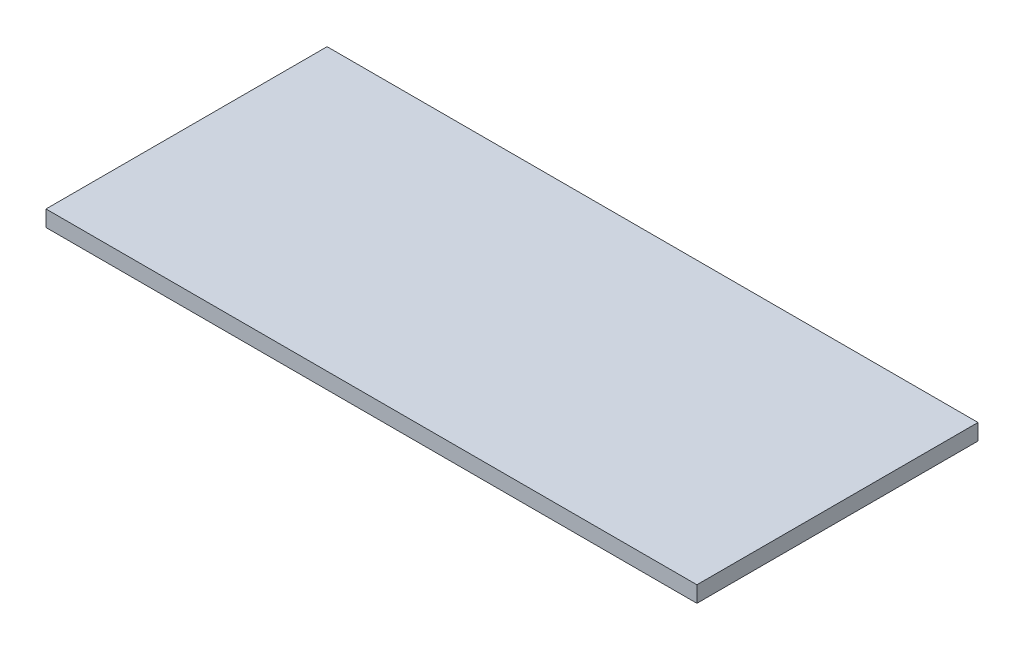
ISO-10303-21;
HEADER;
FILE_DESCRIPTION(('STEP AP214'),'2;1');
FILE_NAME('part.step','',(''),(''),'','','');
FILE_SCHEMA(('AUTOMOTIVE_DESIGN { 1 0 10303 214 1 1 1 1 }'));
ENDSEC;
DATA;
#1=APPLICATION_CONTEXT('core data for automotive mechanical design processes');
#2=APPLICATION_PROTOCOL_DEFINITION('international standard','automotive_design',2000,#1);
#3=PRODUCT_CONTEXT('',#1,'mechanical');
#4=PRODUCT('Part','Part','',(#3));
#5=PRODUCT_RELATED_PRODUCT_CATEGORY('part','',(#4));
#6=PRODUCT_DEFINITION_FORMATION('','',#4);
#7=PRODUCT_DEFINITION_CONTEXT('part definition',#1,'design');
#8=PRODUCT_DEFINITION('design','',#6,#7);
#9=PRODUCT_DEFINITION_SHAPE('','',#8);
#10=(LENGTH_UNIT() NAMED_UNIT(*) SI_UNIT(.MILLI.,.METRE.));
#11=(NAMED_UNIT(*) PLANE_ANGLE_UNIT() SI_UNIT($,.RADIAN.));
#12=(NAMED_UNIT(*) SI_UNIT($,.STERADIAN.) SOLID_ANGLE_UNIT());
#13=UNCERTAINTY_MEASURE_WITH_UNIT(LENGTH_MEASURE(1.E-05),#10,'distance_accuracy_value','');
#14=(GEOMETRIC_REPRESENTATION_CONTEXT(3) GLOBAL_UNCERTAINTY_ASSIGNED_CONTEXT((#13)) GLOBAL_UNIT_ASSIGNED_CONTEXT((#10,
#11,#12)) REPRESENTATION_CONTEXT('',''));
#15=CARTESIAN_POINT('',(0.,0.,0.));
#16=DIRECTION('',(0.,0.,1.));
#17=DIRECTION('',(1.,0.,0.));
#18=AXIS2_PLACEMENT_3D('',#15,#16,#17);
#19=CARTESIAN_POINT('',(1731.38996281445,-71.,0.));
#20=DIRECTION('',(1.,0.,0.));
#21=DIRECTION('',(0.,0.,-1.));
#22=AXIS2_PLACEMENT_3D('',#19,#20,#21);
#23=PLANE('',#22);
#24=DIRECTION('',(0.,0.,-1.));
#25=VECTOR('',#24,1.);
#26=CARTESIAN_POINT('',(1731.38996281445,0.,0.));
#27=LINE('',#26,#25);
#28=CARTESIAN_POINT('',(1731.38996281445,0.,620.));
#29=VERTEX_POINT('',#28);
#30=CARTESIAN_POINT('',(1731.38996281445,0.,-620.));
#31=VERTEX_POINT('',#30);
#32=EDGE_CURVE('E102',#29,#31,#27,.T.);
#33=ORIENTED_EDGE('',*,*,#32,.F.);
#34=DIRECTION('',(0.,1.,0.));
#35=VECTOR('',#34,1.);
#36=CARTESIAN_POINT('',(1731.38996281445,-71.,620.));
#37=LINE('',#36,#35);
#38=CARTESIAN_POINT('',(1731.38996281445,-71.,620.));
#39=VERTEX_POINT('',#38);
#40=EDGE_CURVE('E11',#39,#29,#37,.T.);
#41=ORIENTED_EDGE('',*,*,#40,.F.);
#42=DIRECTION('',(0.,0.,-1.));
#43=VECTOR('',#42,1.);
#44=CARTESIAN_POINT('',(1731.38996281445,-71.,0.));
#45=LINE('',#44,#43);
#46=CARTESIAN_POINT('',(1731.38996281445,-71.,-620.));
#47=VERTEX_POINT('',#46);
#48=EDGE_CURVE('E96',#39,#47,#45,.T.);
#49=ORIENTED_EDGE('',*,*,#48,.T.);
#50=DIRECTION('',(0.,1.,0.));
#51=VECTOR('',#50,1.);
#52=CARTESIAN_POINT('',(1731.38996281445,-71.,-620.));
#53=LINE('',#52,#51);
#54=EDGE_CURVE('E41',#47,#31,#53,.T.);
#55=ORIENTED_EDGE('',*,*,#54,.T.);
#56=EDGE_LOOP('',(#33,#41,#49,#55));
#57=FACE_BOUND('',#56,.T.);
#58=ADVANCED_FACE('F38',(#57),#23,.T.);
#59=CARTESIAN_POINT('',(0.,-71.,620.));
#60=DIRECTION('',(0.,0.,1.));
#61=DIRECTION('',(1.,0.,0.));
#62=AXIS2_PLACEMENT_3D('',#59,#60,#61);
#63=PLANE('',#62);
#64=DIRECTION('',(1.,0.,0.));
#65=VECTOR('',#64,1.);
#66=CARTESIAN_POINT('',(0.,0.,620.));
#67=LINE('',#66,#65);
#68=CARTESIAN_POINT('',(-1140.,0.,620.));
#69=VERTEX_POINT('',#68);
#70=EDGE_CURVE('E98',#69,#29,#67,.T.);
#71=ORIENTED_EDGE('',*,*,#70,.F.);
#72=DIRECTION('',(0.,1.,0.));
#73=VECTOR('',#72,1.);
#74=CARTESIAN_POINT('',(-1140.,-71.,620.));
#75=LINE('',#74,#73);
#76=CARTESIAN_POINT('',(-1140.,-71.,620.));
#77=VERTEX_POINT('',#76);
#78=EDGE_CURVE('E47',#77,#69,#75,.T.);
#79=ORIENTED_EDGE('',*,*,#78,.F.);
#80=DIRECTION('',(1.,0.,0.));
#81=VECTOR('',#80,1.);
#82=CARTESIAN_POINT('',(0.,-71.,620.));
#83=LINE('',#82,#81);
#84=EDGE_CURVE('E89',#77,#39,#83,.T.);
#85=ORIENTED_EDGE('',*,*,#84,.T.);
#86=ORIENTED_EDGE('',*,*,#40,.T.);
#87=EDGE_LOOP('',(#71,#79,#85,#86));
#88=FACE_BOUND('',#87,.T.);
#89=ADVANCED_FACE('F112',(#88),#63,.T.);
#90=CARTESIAN_POINT('',(-1140.,-71.,0.));
#91=DIRECTION('',(1.,0.,0.));
#92=DIRECTION('',(0.,0.,-1.));
#93=AXIS2_PLACEMENT_3D('',#90,#91,#92);
#94=PLANE('',#93);
#95=DIRECTION('',(0.,0.,-1.));
#96=VECTOR('',#95,1.);
#97=CARTESIAN_POINT('',(-1140.,0.,0.));
#98=LINE('',#97,#96);
#99=CARTESIAN_POINT('',(-1140.,0.,-620.));
#100=VERTEX_POINT('',#99);
#101=EDGE_CURVE('E93',#69,#100,#98,.T.);
#102=ORIENTED_EDGE('',*,*,#101,.T.);
#103=DIRECTION('',(0.,1.,0.));
#104=VECTOR('',#103,1.);
#105=CARTESIAN_POINT('',(-1140.,-71.,-620.));
#106=LINE('',#105,#104);
#107=CARTESIAN_POINT('',(-1140.,-71.,-620.));
#108=VERTEX_POINT('',#107);
#109=EDGE_CURVE('E91',#108,#100,#106,.T.);
#110=ORIENTED_EDGE('',*,*,#109,.F.);
#111=DIRECTION('',(0.,0.,-1.));
#112=VECTOR('',#111,1.);
#113=CARTESIAN_POINT('',(-1140.,-71.,0.));
#114=LINE('',#113,#112);
#115=EDGE_CURVE('E85',#77,#108,#114,.T.);
#116=ORIENTED_EDGE('',*,*,#115,.F.);
#117=ORIENTED_EDGE('',*,*,#78,.T.);
#118=EDGE_LOOP('',(#102,#110,#116,#117));
#119=FACE_BOUND('',#118,.T.);
#120=ADVANCED_FACE('F92',(#119),#94,.F.);
#121=CARTESIAN_POINT('',(0.,-71.,-620.));
#122=DIRECTION('',(0.,0.,-1.));
#123=DIRECTION('',(-1.,0.,0.));
#124=AXIS2_PLACEMENT_3D('',#121,#122,#123);
#125=PLANE('',#124);
#126=DIRECTION('',(-1.,0.,0.));
#127=VECTOR('',#126,1.);
#128=CARTESIAN_POINT('',(0.,0.,-620.));
#129=LINE('',#128,#127);
#130=EDGE_CURVE('E105',#31,#100,#129,.T.);
#131=ORIENTED_EDGE('',*,*,#130,.F.);
#132=ORIENTED_EDGE('',*,*,#54,.F.);
#133=DIRECTION('',(-1.,0.,0.));
#134=VECTOR('',#133,1.);
#135=CARTESIAN_POINT('',(0.,-71.,-620.));
#136=LINE('',#135,#134);
#137=EDGE_CURVE('E88',#47,#108,#136,.T.);
#138=ORIENTED_EDGE('',*,*,#137,.T.);
#139=ORIENTED_EDGE('',*,*,#109,.T.);
#140=EDGE_LOOP('',(#131,#132,#138,#139));
#141=FACE_BOUND('',#140,.T.);
#142=ADVANCED_FACE('F95',(#141),#125,.T.);
#143=CARTESIAN_POINT('',(0.,-71.,0.));
#144=DIRECTION('',(0.,1.,0.));
#145=DIRECTION('',(0.,0.,1.));
#146=AXIS2_PLACEMENT_3D('',#143,#144,#145);
#147=PLANE('',#146);
#148=ORIENTED_EDGE('',*,*,#48,.F.);
#149=ORIENTED_EDGE('',*,*,#84,.F.);
#150=ORIENTED_EDGE('',*,*,#115,.T.);
#151=ORIENTED_EDGE('',*,*,#137,.F.);
#152=EDGE_LOOP('',(#148,#149,#150,#151));
#153=FACE_BOUND('',#152,.T.);
#154=ADVANCED_FACE('F87',(#153),#147,.F.);
#155=CARTESIAN_POINT('',(0.,0.,0.));
#156=DIRECTION('',(0.,1.,0.));
#157=DIRECTION('',(0.,0.,1.));
#158=AXIS2_PLACEMENT_3D('',#155,#156,#157);
#159=PLANE('',#158);
#160=ORIENTED_EDGE('',*,*,#32,.T.);
#161=ORIENTED_EDGE('',*,*,#130,.T.);
#162=ORIENTED_EDGE('',*,*,#101,.F.);
#163=ORIENTED_EDGE('',*,*,#70,.T.);
#164=EDGE_LOOP('',(#160,#161,#162,#163));
#165=FACE_BOUND('',#164,.T.);
#166=ADVANCED_FACE('F111',(#165),#159,.T.);
#167=CLOSED_SHELL('',(#58,#89,#120,#142,#154,#166));
#168=MANIFOLD_SOLID_BREP('B2',#167);
#169=ADVANCED_BREP_SHAPE_REPRESENTATION('',(#18,#168),#14);
#170=SHAPE_DEFINITION_REPRESENTATION(#9,#169);
ENDSEC;
END-ISO-10303-21;
